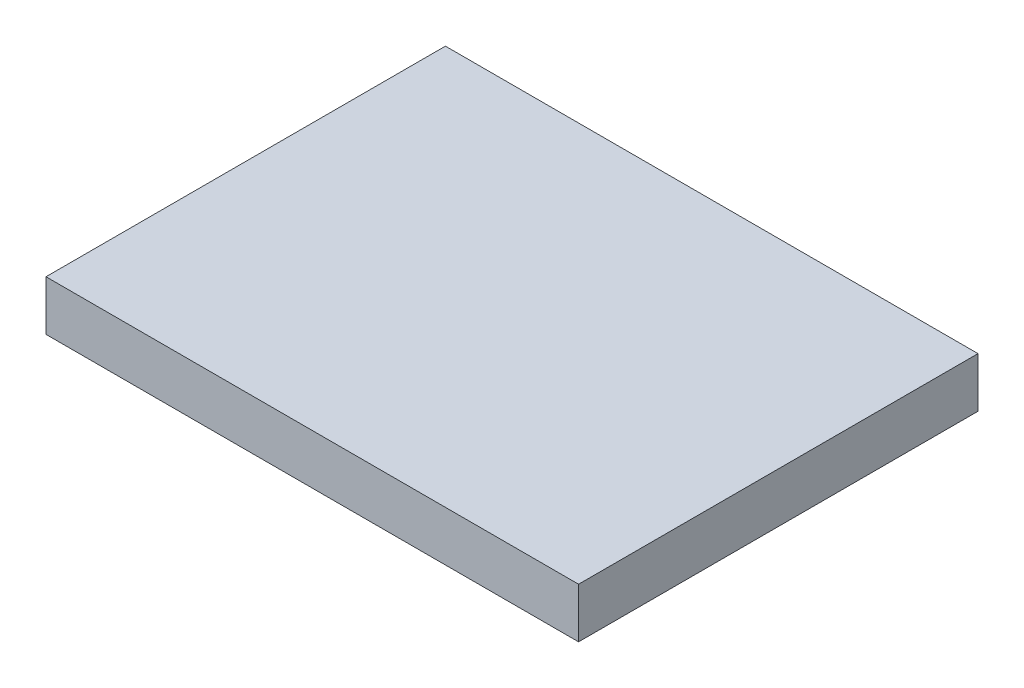
ISO-10303-21;
HEADER;
FILE_DESCRIPTION(('STEP AP214'),'2;1');
FILE_NAME('part.step','',(''),(''),'','','');
FILE_SCHEMA(('AUTOMOTIVE_DESIGN { 1 0 10303 214 1 1 1 1 }'));
ENDSEC;
DATA;
#1=APPLICATION_CONTEXT('core data for automotive mechanical design processes');
#2=APPLICATION_PROTOCOL_DEFINITION('international standard','automotive_design',2000,#1);
#3=PRODUCT_CONTEXT('',#1,'mechanical');
#4=PRODUCT('Part','Part','',(#3));
#5=PRODUCT_RELATED_PRODUCT_CATEGORY('part','',(#4));
#6=PRODUCT_DEFINITION_FORMATION('','',#4);
#7=PRODUCT_DEFINITION_CONTEXT('part definition',#1,'design');
#8=PRODUCT_DEFINITION('design','',#6,#7);
#9=PRODUCT_DEFINITION_SHAPE('','',#8);
#10=(LENGTH_UNIT() NAMED_UNIT(*) SI_UNIT(.MILLI.,.METRE.));
#11=(NAMED_UNIT(*) PLANE_ANGLE_UNIT() SI_UNIT($,.RADIAN.));
#12=(NAMED_UNIT(*) SI_UNIT($,.STERADIAN.) SOLID_ANGLE_UNIT());
#13=UNCERTAINTY_MEASURE_WITH_UNIT(LENGTH_MEASURE(1.E-05),#10,'distance_accuracy_value','');
#14=(GEOMETRIC_REPRESENTATION_CONTEXT(3) GLOBAL_UNCERTAINTY_ASSIGNED_CONTEXT((#13)) GLOBAL_UNIT_ASSIGNED_CONTEXT((#10,
#11,#12)) REPRESENTATION_CONTEXT('',''));
#15=CARTESIAN_POINT('',(0.,0.,0.));
#16=DIRECTION('',(0.,0.,1.));
#17=DIRECTION('',(1.,0.,0.));
#18=AXIS2_PLACEMENT_3D('',#15,#16,#17);
#19=CARTESIAN_POINT('',(25.4,4.7625,19.05));
#20=DIRECTION('',(-1.,0.,0.));
#21=DIRECTION('',(0.,0.,1.));
#22=AXIS2_PLACEMENT_3D('',#19,#20,#21);
#23=PLANE('',#22);
#24=DIRECTION('',(0.,0.,-1.));
#25=VECTOR('',#24,1.);
#26=CARTESIAN_POINT('',(25.4,0.,19.05));
#27=LINE('',#26,#25);
#28=CARTESIAN_POINT('',(25.4,0.,19.05));
#29=VERTEX_POINT('',#28);
#30=CARTESIAN_POINT('',(25.4,0.,-19.05));
#31=VERTEX_POINT('',#30);
#32=EDGE_CURVE('E102',#29,#31,#27,.T.);
#33=ORIENTED_EDGE('',*,*,#32,.T.);
#34=DIRECTION('',(0.,-1.,0.));
#35=VECTOR('',#34,1.);
#36=CARTESIAN_POINT('',(25.4,4.7625,-19.05));
#37=LINE('',#36,#35);
#38=CARTESIAN_POINT('',(25.4,4.7625,-19.05));
#39=VERTEX_POINT('',#38);
#40=EDGE_CURVE('E11',#39,#31,#37,.T.);
#41=ORIENTED_EDGE('',*,*,#40,.F.);
#42=DIRECTION('',(0.,0.,-1.));
#43=VECTOR('',#42,1.);
#44=CARTESIAN_POINT('',(25.4,4.7625,19.05));
#45=LINE('',#44,#43);
#46=CARTESIAN_POINT('',(25.4,4.7625,19.05));
#47=VERTEX_POINT('',#46);
#48=EDGE_CURVE('E90',#47,#39,#45,.T.);
#49=ORIENTED_EDGE('',*,*,#48,.F.);
#50=DIRECTION('',(0.,-1.,0.));
#51=VECTOR('',#50,1.);
#52=CARTESIAN_POINT('',(25.4,4.7625,19.05));
#53=LINE('',#52,#51);
#54=EDGE_CURVE('E98',#47,#29,#53,.T.);
#55=ORIENTED_EDGE('',*,*,#54,.T.);
#56=EDGE_LOOP('',(#33,#41,#49,#55));
#57=FACE_BOUND('',#56,.T.);
#58=ADVANCED_FACE('F39',(#57),#23,.F.);
#59=CARTESIAN_POINT('',(-25.4,4.7625,-19.05));
#60=DIRECTION('',(0.,0.,1.));
#61=DIRECTION('',(1.,0.,0.));
#62=AXIS2_PLACEMENT_3D('',#59,#60,#61);
#63=PLANE('',#62);
#64=DIRECTION('',(-1.,0.,0.));
#65=VECTOR('',#64,1.);
#66=CARTESIAN_POINT('',(-25.4,0.,-19.05));
#67=LINE('',#66,#65);
#68=CARTESIAN_POINT('',(-25.4,0.,-19.05));
#69=VERTEX_POINT('',#68);
#70=EDGE_CURVE('E94',#31,#69,#67,.T.);
#71=ORIENTED_EDGE('',*,*,#70,.T.);
#72=DIRECTION('',(0.,-1.,0.));
#73=VECTOR('',#72,1.);
#74=CARTESIAN_POINT('',(-25.4,4.7625,-19.05));
#75=LINE('',#74,#73);
#76=CARTESIAN_POINT('',(-25.4,4.7625,-19.05));
#77=VERTEX_POINT('',#76);
#78=EDGE_CURVE('E47',#77,#69,#75,.T.);
#79=ORIENTED_EDGE('',*,*,#78,.F.);
#80=DIRECTION('',(-1.,0.,0.));
#81=VECTOR('',#80,1.);
#82=CARTESIAN_POINT('',(-25.4,4.7625,-19.05));
#83=LINE('',#82,#81);
#84=EDGE_CURVE('E85',#39,#77,#83,.T.);
#85=ORIENTED_EDGE('',*,*,#84,.F.);
#86=ORIENTED_EDGE('',*,*,#40,.T.);
#87=EDGE_LOOP('',(#71,#79,#85,#86));
#88=FACE_BOUND('',#87,.T.);
#89=ADVANCED_FACE('F93',(#88),#63,.F.);
#90=CARTESIAN_POINT('',(-25.4,4.7625,19.05));
#91=DIRECTION('',(1.,0.,0.));
#92=DIRECTION('',(0.,0.,-1.));
#93=AXIS2_PLACEMENT_3D('',#90,#91,#92);
#94=PLANE('',#93);
#95=DIRECTION('',(0.,0.,1.));
#96=VECTOR('',#95,1.);
#97=CARTESIAN_POINT('',(-25.4,0.,19.05));
#98=LINE('',#97,#96);
#99=CARTESIAN_POINT('',(-25.4,0.,19.05));
#100=VERTEX_POINT('',#99);
#101=EDGE_CURVE('E72',#69,#100,#98,.T.);
#102=ORIENTED_EDGE('',*,*,#101,.T.);
#103=DIRECTION('',(0.,-1.,0.));
#104=VECTOR('',#103,1.);
#105=CARTESIAN_POINT('',(-25.4,4.7625,19.05));
#106=LINE('',#105,#104);
#107=CARTESIAN_POINT('',(-25.4,4.7625,19.05));
#108=VERTEX_POINT('',#107);
#109=EDGE_CURVE('E95',#108,#100,#106,.T.);
#110=ORIENTED_EDGE('',*,*,#109,.F.);
#111=DIRECTION('',(0.,0.,1.));
#112=VECTOR('',#111,1.);
#113=CARTESIAN_POINT('',(-25.4,4.7625,19.05));
#114=LINE('',#113,#112);
#115=EDGE_CURVE('E88',#77,#108,#114,.T.);
#116=ORIENTED_EDGE('',*,*,#115,.F.);
#117=ORIENTED_EDGE('',*,*,#78,.T.);
#118=EDGE_LOOP('',(#102,#110,#116,#117));
#119=FACE_BOUND('',#118,.T.);
#120=ADVANCED_FACE('F96',(#119),#94,.F.);
#121=CARTESIAN_POINT('',(-25.4,4.7625,19.05));
#122=DIRECTION('',(0.,0.,-1.));
#123=DIRECTION('',(-1.,0.,0.));
#124=AXIS2_PLACEMENT_3D('',#121,#122,#123);
#125=PLANE('',#124);
#126=DIRECTION('',(1.,0.,0.));
#127=VECTOR('',#126,1.);
#128=CARTESIAN_POINT('',(-25.4,0.,19.05));
#129=LINE('',#128,#127);
#130=EDGE_CURVE('E78',#100,#29,#129,.T.);
#131=ORIENTED_EDGE('',*,*,#130,.T.);
#132=ORIENTED_EDGE('',*,*,#54,.F.);
#133=DIRECTION('',(1.,0.,0.));
#134=VECTOR('',#133,1.);
#135=CARTESIAN_POINT('',(-25.4,4.7625,19.05));
#136=LINE('',#135,#134);
#137=EDGE_CURVE('E55',#108,#47,#136,.T.);
#138=ORIENTED_EDGE('',*,*,#137,.F.);
#139=ORIENTED_EDGE('',*,*,#109,.T.);
#140=EDGE_LOOP('',(#131,#132,#138,#139));
#141=FACE_BOUND('',#140,.T.);
#142=ADVANCED_FACE('F109',(#141),#125,.F.);
#143=CARTESIAN_POINT('',(0.,4.7625,0.));
#144=DIRECTION('',(0.,-1.,0.));
#145=DIRECTION('',(0.,0.,-1.));
#146=AXIS2_PLACEMENT_3D('',#143,#144,#145);
#147=PLANE('',#146);
#148=ORIENTED_EDGE('',*,*,#48,.T.);
#149=ORIENTED_EDGE('',*,*,#84,.T.);
#150=ORIENTED_EDGE('',*,*,#115,.T.);
#151=ORIENTED_EDGE('',*,*,#137,.T.);
#152=EDGE_LOOP('',(#148,#149,#150,#151));
#153=FACE_BOUND('',#152,.T.);
#154=ADVANCED_FACE('F86',(#153),#147,.F.);
#155=CARTESIAN_POINT('',(0.,0.,0.));
#156=DIRECTION('',(0.,-1.,0.));
#157=DIRECTION('',(0.,0.,-1.));
#158=AXIS2_PLACEMENT_3D('',#155,#156,#157);
#159=PLANE('',#158);
#160=ORIENTED_EDGE('',*,*,#32,.F.);
#161=ORIENTED_EDGE('',*,*,#130,.F.);
#162=ORIENTED_EDGE('',*,*,#101,.F.);
#163=ORIENTED_EDGE('',*,*,#70,.F.);
#164=EDGE_LOOP('',(#160,#161,#162,#163));
#165=FACE_BOUND('',#164,.T.);
#166=ADVANCED_FACE('F112',(#165),#159,.T.);
#167=CLOSED_SHELL('',(#58,#89,#120,#142,#154,#166));
#168=MANIFOLD_SOLID_BREP('B2',#167);
#169=ADVANCED_BREP_SHAPE_REPRESENTATION('',(#18,#168),#14);
#170=SHAPE_DEFINITION_REPRESENTATION(#9,#169);
ENDSEC;
END-ISO-10303-21;
